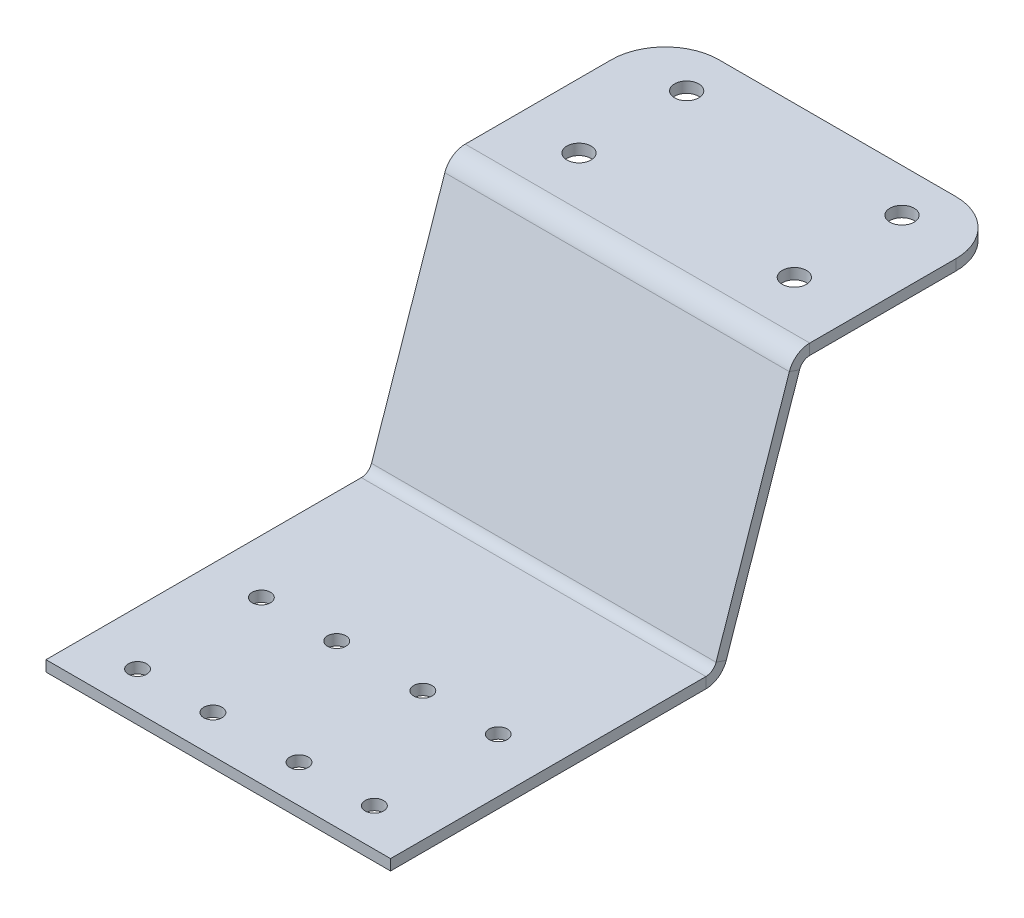
ISO-10303-21;
HEADER;
FILE_DESCRIPTION(('STEP AP214'),'2;1');
FILE_NAME('part.step','',(''),(''),'','','');
FILE_SCHEMA(('AUTOMOTIVE_DESIGN { 1 0 10303 214 1 1 1 1 }'));
ENDSEC;
DATA;
#1=APPLICATION_CONTEXT('core data for automotive mechanical design processes');
#2=APPLICATION_PROTOCOL_DEFINITION('international standard','automotive_design',2000,#1);
#3=PRODUCT_CONTEXT('',#1,'mechanical');
#4=PRODUCT('Part','Part','',(#3));
#5=PRODUCT_RELATED_PRODUCT_CATEGORY('part','',(#4));
#6=PRODUCT_DEFINITION_FORMATION('','',#4);
#7=PRODUCT_DEFINITION_CONTEXT('part definition',#1,'design');
#8=PRODUCT_DEFINITION('design','',#6,#7);
#9=PRODUCT_DEFINITION_SHAPE('','',#8);
#10=(LENGTH_UNIT() NAMED_UNIT(*) SI_UNIT(.MILLI.,.METRE.));
#11=(NAMED_UNIT(*) PLANE_ANGLE_UNIT() SI_UNIT($,.RADIAN.));
#12=(NAMED_UNIT(*) SI_UNIT($,.STERADIAN.) SOLID_ANGLE_UNIT());
#13=UNCERTAINTY_MEASURE_WITH_UNIT(LENGTH_MEASURE(1.E-05),#10,'distance_accuracy_value','');
#14=(GEOMETRIC_REPRESENTATION_CONTEXT(3) GLOBAL_UNCERTAINTY_ASSIGNED_CONTEXT((#13)) GLOBAL_UNIT_ASSIGNED_CONTEXT((#10,
#11,#12)) REPRESENTATION_CONTEXT('',''));
#15=CARTESIAN_POINT('',(0.,0.,0.));
#16=DIRECTION('',(0.,0.,1.));
#17=DIRECTION('',(1.,0.,0.));
#18=AXIS2_PLACEMENT_3D('',#15,#16,#17);
#19=CARTESIAN_POINT('',(32.,1.35465214442372,-60.4618132310535));
#20=DIRECTION('',(1.,0.,0.));
#21=DIRECTION('',(0.,0.,-1.));
#22=AXIS2_PLACEMENT_3D('',#19,#20,#21);
#23=PLANE('',#22);
#24=DIRECTION('',(0.,-0.322673927788138,-0.94651018817854));
#25=VECTOR('',#24,1.);
#26=CARTESIAN_POINT('',(32.,1.35465214442372,-60.4618132310535));
#27=LINE('',#26,#25);
#28=CARTESIAN_POINT('',(32.,1.35465214442372,-60.4618132310535));
#29=VERTEX_POINT('',#28);
#30=CARTESIAN_POINT('',(32.,0.709304288847448,-62.3548336074106));
#31=VERTEX_POINT('',#30);
#32=EDGE_CURVE('E265',#29,#31,#27,.T.);
#33=ORIENTED_EDGE('',*,*,#32,.F.);
#34=CARTESIAN_POINT('',(32.,2.,-58.5687928546965));
#35=DIRECTION('',(-1.,0.,0.));
#36=DIRECTION('',(0.,0.,1.));
#37=AXIS2_PLACEMENT_3D('',#34,#35,#36);
#38=CIRCLE('',#37,2.);
#39=CARTESIAN_POINT('',(32.,0.,-58.5687928546965));
#40=VERTEX_POINT('',#39);
#41=EDGE_CURVE('E175',#40,#29,#38,.F.);
#42=ORIENTED_EDGE('',*,*,#41,.F.);
#43=DIRECTION('',(0.,1.,0.));
#44=VECTOR('',#43,1.);
#45=CARTESIAN_POINT('',(32.,-2.,-58.5687928546965));
#46=LINE('',#45,#44);
#47=CARTESIAN_POINT('',(32.,-2.,-58.5687928546965));
#48=VERTEX_POINT('',#47);
#49=EDGE_CURVE('E263',#48,#40,#46,.T.);
#50=ORIENTED_EDGE('',*,*,#49,.F.);
#51=CARTESIAN_POINT('',(32.,2.,-58.5687928546965));
#52=DIRECTION('',(1.,0.,0.));
#53=DIRECTION('',(0.,0.,-1.));
#54=AXIS2_PLACEMENT_3D('',#51,#52,#53);
#55=CIRCLE('',#54,4.);
#56=EDGE_CURVE('E190',#48,#31,#55,.T.);
#57=ORIENTED_EDGE('',*,*,#56,.T.);
#58=EDGE_LOOP('',(#33,#42,#50,#57));
#59=FACE_BOUND('',#58,.T.);
#60=ADVANCED_FACE('F38',(#59),#23,.T.);
#61=CARTESIAN_POINT('',(32.,-2.,-58.5687928546965));
#62=DIRECTION('',(1.,0.,0.));
#63=DIRECTION('',(0.,0.,-1.));
#64=AXIS2_PLACEMENT_3D('',#61,#62,#63);
#65=PLANE('',#64);
#66=DIRECTION('',(0.,0.94651018817854,-0.322673927788138));
#67=VECTOR('',#66,1.);
#68=CARTESIAN_POINT('',(32.,0.,-60.));
#69=LINE('',#68,#67);
#70=CARTESIAN_POINT('',(32.,41.2906957111525,-74.0763735378929));
#71=VERTEX_POINT('',#70);
#72=EDGE_CURVE('E173',#29,#71,#69,.T.);
#73=ORIENTED_EDGE('',*,*,#72,.F.);
#74=ORIENTED_EDGE('',*,*,#32,.T.);
#75=DIRECTION('',(0.,0.94651018817854,-0.322673927788138));
#76=VECTOR('',#75,1.);
#77=CARTESIAN_POINT('',(32.,-0.645347855576277,-61.8930203763571));
#78=LINE('',#77,#76);
#79=CARTESIAN_POINT('',(32.,40.6453478555763,-75.96939391425));
#80=VERTEX_POINT('',#79);
#81=EDGE_CURVE('E193',#31,#80,#78,.T.);
#82=ORIENTED_EDGE('',*,*,#81,.T.);
#83=DIRECTION('',(0.,0.322673927788137,0.94651018817854));
#84=VECTOR('',#83,1.);
#85=CARTESIAN_POINT('',(32.,40.6453478555763,-75.96939391425));
#86=LINE('',#85,#84);
#87=EDGE_CURVE('E153',#80,#71,#86,.T.);
#88=ORIENTED_EDGE('',*,*,#87,.T.);
#89=EDGE_LOOP('',(#73,#74,#82,#88));
#90=FACE_BOUND('',#89,.T.);
#91=ADVANCED_FACE('F395',(#90),#65,.T.);
#92=CARTESIAN_POINT('',(-32.,0.,-58.5687928546965));
#93=DIRECTION('',(-1.,0.,0.));
#94=DIRECTION('',(0.,0.,1.));
#95=AXIS2_PLACEMENT_3D('',#92,#93,#94);
#96=PLANE('',#95);
#97=DIRECTION('',(0.,-1.,0.));
#98=VECTOR('',#97,1.);
#99=CARTESIAN_POINT('',(-32.,0.,-58.5687928546965));
#100=LINE('',#99,#98);
#101=CARTESIAN_POINT('',(-32.,0.,-58.5687928546965));
#102=VERTEX_POINT('',#101);
#103=CARTESIAN_POINT('',(-32.,-2.,-58.5687928546965));
#104=VERTEX_POINT('',#103);
#105=EDGE_CURVE('E261',#102,#104,#100,.T.);
#106=ORIENTED_EDGE('',*,*,#105,.F.);
#107=CARTESIAN_POINT('',(-32.,2.,-58.5687928546965));
#108=DIRECTION('',(-1.,0.,0.));
#109=DIRECTION('',(0.,0.,1.));
#110=AXIS2_PLACEMENT_3D('',#107,#108,#109);
#111=CIRCLE('',#110,2.);
#112=CARTESIAN_POINT('',(-32.,1.35465214442372,-60.4618132310535));
#113=VERTEX_POINT('',#112);
#114=EDGE_CURVE('E208',#102,#113,#111,.F.);
#115=ORIENTED_EDGE('',*,*,#114,.T.);
#116=DIRECTION('',(0.,0.322673927788138,0.94651018817854));
#117=VECTOR('',#116,1.);
#118=CARTESIAN_POINT('',(-32.,0.709304288847448,-62.3548336074106));
#119=LINE('',#118,#117);
#120=CARTESIAN_POINT('',(-32.,0.709304288847448,-62.3548336074106));
#121=VERTEX_POINT('',#120);
#122=EDGE_CURVE('E152',#121,#113,#119,.T.);
#123=ORIENTED_EDGE('',*,*,#122,.F.);
#124=CARTESIAN_POINT('',(-32.,2.,-58.5687928546965));
#125=DIRECTION('',(1.,0.,0.));
#126=DIRECTION('',(0.,0.,-1.));
#127=AXIS2_PLACEMENT_3D('',#124,#125,#126);
#128=CIRCLE('',#127,4.);
#129=EDGE_CURVE('E220',#104,#121,#128,.T.);
#130=ORIENTED_EDGE('',*,*,#129,.F.);
#131=EDGE_LOOP('',(#106,#115,#123,#130));
#132=FACE_BOUND('',#131,.T.);
#133=ADVANCED_FACE('F401',(#132),#96,.T.);
#134=CARTESIAN_POINT('',(-32.,0.709304288847448,-62.3548336074106));
#135=DIRECTION('',(-1.,0.,0.));
#136=DIRECTION('',(0.,0.,1.));
#137=AXIS2_PLACEMENT_3D('',#134,#135,#136);
#138=PLANE('',#137);
#139=DIRECTION('',(0.,0.,-1.));
#140=VECTOR('',#139,1.);
#141=CARTESIAN_POINT('',(-32.,0.,0.));
#142=LINE('',#141,#140);
#143=CARTESIAN_POINT('',(-32.,0.,0.));
#144=VERTEX_POINT('',#143);
#145=EDGE_CURVE('E211',#144,#102,#142,.T.);
#146=ORIENTED_EDGE('',*,*,#145,.T.);
#147=ORIENTED_EDGE('',*,*,#105,.T.);
#148=DIRECTION('',(0.,0.,-1.));
#149=VECTOR('',#148,1.);
#150=CARTESIAN_POINT('',(-32.,-2.,0.));
#151=LINE('',#150,#149);
#152=CARTESIAN_POINT('',(-32.,-2.,0.));
#153=VERTEX_POINT('',#152);
#154=EDGE_CURVE('E217',#153,#104,#151,.T.);
#155=ORIENTED_EDGE('',*,*,#154,.F.);
#156=DIRECTION('',(0.,1.,0.));
#157=VECTOR('',#156,1.);
#158=CARTESIAN_POINT('',(-32.,-2.,0.));
#159=LINE('',#158,#157);
#160=EDGE_CURVE('E214',#153,#144,#159,.T.);
#161=ORIENTED_EDGE('',*,*,#160,.T.);
#162=EDGE_LOOP('',(#146,#147,#155,#161));
#163=FACE_BOUND('',#162,.T.);
#164=ADVANCED_FACE('F698',(#163),#138,.T.);
#165=CARTESIAN_POINT('',(32.,44.,-77.8624142906071));
#166=DIRECTION('',(1.,0.,0.));
#167=DIRECTION('',(0.,0.,-1.));
#168=AXIS2_PLACEMENT_3D('',#165,#166,#167);
#169=PLANE('',#168);
#170=DIRECTION('',(0.,-1.,0.));
#171=VECTOR('',#170,1.);
#172=CARTESIAN_POINT('',(32.,44.,-77.8624142906071));
#173=LINE('',#172,#171);
#174=CARTESIAN_POINT('',(32.,44.,-77.8624142906071));
#175=VERTEX_POINT('',#174);
#176=CARTESIAN_POINT('',(32.,42.,-77.8624142906071));
#177=VERTEX_POINT('',#176);
#178=EDGE_CURVE('E143',#175,#177,#173,.T.);
#179=ORIENTED_EDGE('',*,*,#178,.F.);
#180=CARTESIAN_POINT('',(32.,40.,-77.8624142906071));
#181=DIRECTION('',(1.,0.,0.));
#182=DIRECTION('',(0.,0.,-1.));
#183=AXIS2_PLACEMENT_3D('',#180,#181,#182);
#184=CIRCLE('',#183,4.);
#185=EDGE_CURVE('E147',#71,#175,#184,.F.);
#186=ORIENTED_EDGE('',*,*,#185,.F.);
#187=ORIENTED_EDGE('',*,*,#87,.F.);
#188=CARTESIAN_POINT('',(32.,40.,-77.8624142906071));
#189=DIRECTION('',(1.,0.,0.));
#190=DIRECTION('',(0.,0.,-1.));
#191=AXIS2_PLACEMENT_3D('',#188,#189,#190);
#192=CIRCLE('',#191,2.);
#193=EDGE_CURVE('E150',#80,#177,#192,.F.);
#194=ORIENTED_EDGE('',*,*,#193,.T.);
#195=EDGE_LOOP('',(#179,#186,#187,#194));
#196=FACE_BOUND('',#195,.T.);
#197=ADVANCED_FACE('F145',(#196),#169,.T.);
#198=CARTESIAN_POINT('',(32.,40.6453478555763,-75.96939391425));
#199=DIRECTION('',(1.,0.,0.));
#200=DIRECTION('',(0.,0.,-1.));
#201=AXIS2_PLACEMENT_3D('',#198,#199,#200);
#202=PLANE('',#201);
#203=DIRECTION('',(0.,0.,-1.));
#204=VECTOR('',#203,1.);
#205=CARTESIAN_POINT('',(32.,42.,-75.));
#206=LINE('',#205,#204);
#207=CARTESIAN_POINT('',(32.,42.,-105.));
#208=VERTEX_POINT('',#207);
#209=EDGE_CURVE('E168',#177,#208,#206,.T.);
#210=ORIENTED_EDGE('',*,*,#209,.T.);
#211=DIRECTION('',(0.,-1.,0.));
#212=VECTOR('',#211,1.);
#213=CARTESIAN_POINT('',(32.,40.6453478555763,-105.));
#214=LINE('',#213,#212);
#215=CARTESIAN_POINT('',(32.,44.,-105.));
#216=VERTEX_POINT('',#215);
#217=EDGE_CURVE('E61',#208,#216,#214,.F.);
#218=ORIENTED_EDGE('',*,*,#217,.T.);
#219=DIRECTION('',(0.,0.,-1.));
#220=VECTOR('',#219,1.);
#221=CARTESIAN_POINT('',(32.,44.,-75.));
#222=LINE('',#221,#220);
#223=EDGE_CURVE('E158',#175,#216,#222,.T.);
#224=ORIENTED_EDGE('',*,*,#223,.F.);
#225=ORIENTED_EDGE('',*,*,#178,.T.);
#226=EDGE_LOOP('',(#210,#218,#224,#225));
#227=FACE_BOUND('',#226,.T.);
#228=ADVANCED_FACE('F167',(#227),#202,.T.);
#229=CARTESIAN_POINT('',(-32.,41.2906957111525,-74.0763735378929));
#230=DIRECTION('',(-1.,0.,0.));
#231=DIRECTION('',(0.,0.,1.));
#232=AXIS2_PLACEMENT_3D('',#229,#230,#231);
#233=PLANE('',#232);
#234=DIRECTION('',(0.,-0.322673927788137,-0.94651018817854));
#235=VECTOR('',#234,1.);
#236=CARTESIAN_POINT('',(-32.,41.2906957111525,-74.0763735378929));
#237=LINE('',#236,#235);
#238=CARTESIAN_POINT('',(-32.,41.2906957111525,-74.0763735378929));
#239=VERTEX_POINT('',#238);
#240=CARTESIAN_POINT('',(-32.,40.6453478555763,-75.96939391425));
#241=VERTEX_POINT('',#240);
#242=EDGE_CURVE('E257',#239,#241,#237,.T.);
#243=ORIENTED_EDGE('',*,*,#242,.F.);
#244=CARTESIAN_POINT('',(-32.,40.,-77.8624142906071));
#245=DIRECTION('',(1.,0.,0.));
#246=DIRECTION('',(0.,0.,-1.));
#247=AXIS2_PLACEMENT_3D('',#244,#245,#246);
#248=CIRCLE('',#247,4.);
#249=CARTESIAN_POINT('',(-32.,44.,-77.8624142906071));
#250=VERTEX_POINT('',#249);
#251=EDGE_CURVE('E203',#239,#250,#248,.F.);
#252=ORIENTED_EDGE('',*,*,#251,.T.);
#253=DIRECTION('',(0.,1.,0.));
#254=VECTOR('',#253,1.);
#255=CARTESIAN_POINT('',(-32.,42.,-77.8624142906071));
#256=LINE('',#255,#254);
#257=CARTESIAN_POINT('',(-32.,42.,-77.8624142906071));
#258=VERTEX_POINT('',#257);
#259=EDGE_CURVE('E255',#258,#250,#256,.T.);
#260=ORIENTED_EDGE('',*,*,#259,.F.);
#261=CARTESIAN_POINT('',(-32.,40.,-77.8624142906071));
#262=DIRECTION('',(1.,0.,0.));
#263=DIRECTION('',(0.,0.,-1.));
#264=AXIS2_PLACEMENT_3D('',#261,#262,#263);
#265=CIRCLE('',#264,2.);
#266=EDGE_CURVE('E226',#241,#258,#265,.F.);
#267=ORIENTED_EDGE('',*,*,#266,.F.);
#268=EDGE_LOOP('',(#243,#252,#260,#267));
#269=FACE_BOUND('',#268,.T.);
#270=ADVANCED_FACE('F390',(#269),#233,.T.);
#271=CARTESIAN_POINT('',(-32.,42.,-77.8624142906071));
#272=DIRECTION('',(-1.,0.,0.));
#273=DIRECTION('',(0.,0.,1.));
#274=AXIS2_PLACEMENT_3D('',#271,#272,#273);
#275=PLANE('',#274);
#276=DIRECTION('',(0.,0.94651018817854,-0.322673927788138));
#277=VECTOR('',#276,1.);
#278=CARTESIAN_POINT('',(-32.,0.,-60.));
#279=LINE('',#278,#277);
#280=EDGE_CURVE('E205',#113,#239,#279,.T.);
#281=ORIENTED_EDGE('',*,*,#280,.T.);
#282=ORIENTED_EDGE('',*,*,#242,.T.);
#283=DIRECTION('',(0.,0.94651018817854,-0.322673927788138));
#284=VECTOR('',#283,1.);
#285=CARTESIAN_POINT('',(-32.,-0.645347855576277,-61.8930203763571));
#286=LINE('',#285,#284);
#287=EDGE_CURVE('E223',#121,#241,#286,.T.);
#288=ORIENTED_EDGE('',*,*,#287,.F.);
#289=ORIENTED_EDGE('',*,*,#122,.T.);
#290=EDGE_LOOP('',(#281,#282,#288,#289));
#291=FACE_BOUND('',#290,.T.);
#292=ADVANCED_FACE('F382',(#291),#275,.T.);
#293=CARTESIAN_POINT('',(32.,42.,-75.));
#294=DIRECTION('',(0.,1.,0.));
#295=DIRECTION('',(0.,0.,1.));
#296=AXIS2_PLACEMENT_3D('',#293,#294,#295);
#297=PLANE('',#296);
#298=CARTESIAN_POINT('',(-20.,42.,-107.));
#299=DIRECTION('',(0.,1.,0.));
#300=DIRECTION('',(0.,0.,1.));
#301=AXIS2_PLACEMENT_3D('',#298,#299,#300);
#302=CIRCLE('',#301,2.25);
#303=CARTESIAN_POINT('',(-20.,42.,-104.75));
#304=VERTEX_POINT('',#303);
#305=EDGE_CURVE('E354',#304,#304,#302,.T.);
#306=ORIENTED_EDGE('',*,*,#305,.T.);
#307=EDGE_LOOP('',(#306));
#308=FACE_BOUND('',#307,.T.);
#309=CARTESIAN_POINT('',(-20.,42.,-87.));
#310=DIRECTION('',(0.,1.,0.));
#311=DIRECTION('',(0.,0.,1.));
#312=AXIS2_PLACEMENT_3D('',#309,#310,#311);
#313=CIRCLE('',#312,2.25);
#314=CARTESIAN_POINT('',(-20.,42.,-84.75));
#315=VERTEX_POINT('',#314);
#316=EDGE_CURVE('E348',#315,#315,#313,.T.);
#317=ORIENTED_EDGE('',*,*,#316,.T.);
#318=EDGE_LOOP('',(#317));
#319=FACE_BOUND('',#318,.T.);
#320=CARTESIAN_POINT('',(20.,42.,-87.));
#321=DIRECTION('',(0.,1.,0.));
#322=DIRECTION('',(0.,0.,1.));
#323=AXIS2_PLACEMENT_3D('',#320,#321,#322);
#324=CIRCLE('',#323,2.25);
#325=CARTESIAN_POINT('',(20.,42.,-84.75));
#326=VERTEX_POINT('',#325);
#327=EDGE_CURVE('E342',#326,#326,#324,.T.);
#328=ORIENTED_EDGE('',*,*,#327,.T.);
#329=EDGE_LOOP('',(#328));
#330=FACE_BOUND('',#329,.T.);
#331=CARTESIAN_POINT('',(20.,42.,-107.));
#332=DIRECTION('',(0.,1.,0.));
#333=DIRECTION('',(0.,0.,1.));
#334=AXIS2_PLACEMENT_3D('',#331,#332,#333);
#335=CIRCLE('',#334,2.25);
#336=CARTESIAN_POINT('',(20.,42.,-104.75));
#337=VERTEX_POINT('',#336);
#338=EDGE_CURVE('E336',#337,#337,#335,.T.);
#339=ORIENTED_EDGE('',*,*,#338,.T.);
#340=EDGE_LOOP('',(#339));
#341=FACE_BOUND('',#340,.T.);
#342=DIRECTION('',(-1.,0.,0.));
#343=VECTOR('',#342,1.);
#344=CARTESIAN_POINT('',(32.,42.,-115.));
#345=LINE('',#344,#343);
#346=CARTESIAN_POINT('',(22.,42.,-115.));
#347=VERTEX_POINT('',#346);
#348=CARTESIAN_POINT('',(-22.,42.,-115.));
#349=VERTEX_POINT('',#348);
#350=EDGE_CURVE('E252',#347,#349,#345,.T.);
#351=ORIENTED_EDGE('',*,*,#350,.F.);
#352=CARTESIAN_POINT('',(22.,42.,-105.));
#353=DIRECTION('',(0.,1.,0.));
#354=DIRECTION('',(0.,0.,1.));
#355=AXIS2_PLACEMENT_3D('',#352,#353,#354);
#356=CIRCLE('',#355,10.);
#357=EDGE_CURVE('E274',#347,#208,#356,.F.);
#358=ORIENTED_EDGE('',*,*,#357,.T.);
#359=ORIENTED_EDGE('',*,*,#209,.F.);
#360=DIRECTION('',(-1.,0.,0.));
#361=VECTOR('',#360,1.);
#362=CARTESIAN_POINT('',(32.,42.,-77.8624142906071));
#363=LINE('',#362,#361);
#364=EDGE_CURVE('E197',#177,#258,#363,.T.);
#365=ORIENTED_EDGE('',*,*,#364,.T.);
#366=DIRECTION('',(0.,0.,-1.));
#367=VECTOR('',#366,1.);
#368=CARTESIAN_POINT('',(-32.,42.,-75.));
#369=LINE('',#368,#367);
#370=CARTESIAN_POINT('',(-32.,42.,-105.));
#371=VERTEX_POINT('',#370);
#372=EDGE_CURVE('E198',#258,#371,#369,.T.);
#373=ORIENTED_EDGE('',*,*,#372,.T.);
#374=CARTESIAN_POINT('',(-22.,42.,-105.));
#375=DIRECTION('',(0.,1.,0.));
#376=DIRECTION('',(0.,0.,1.));
#377=AXIS2_PLACEMENT_3D('',#374,#375,#376);
#378=CIRCLE('',#377,10.);
#379=EDGE_CURVE('E272',#371,#349,#378,.F.);
#380=ORIENTED_EDGE('',*,*,#379,.T.);
#381=EDGE_LOOP('',(#351,#358,#359,#365,#373,#380));
#382=FACE_BOUND('',#381,.T.);
#383=ADVANCED_FACE('F287',(#308,#319,#330,#341,#382),#297,.F.);
#384=CARTESIAN_POINT('',(32.,44.,-115.));
#385=DIRECTION('',(0.,0.,-1.));
#386=DIRECTION('',(-1.,0.,0.));
#387=AXIS2_PLACEMENT_3D('',#384,#385,#386);
#388=PLANE('',#387);
#389=DIRECTION('',(-1.,0.,0.));
#390=VECTOR('',#389,1.);
#391=CARTESIAN_POINT('',(32.,44.,-115.));
#392=LINE('',#391,#390);
#393=CARTESIAN_POINT('',(22.,44.,-115.));
#394=VERTEX_POINT('',#393);
#395=CARTESIAN_POINT('',(-22.,44.,-115.));
#396=VERTEX_POINT('',#395);
#397=EDGE_CURVE('E164',#394,#396,#392,.T.);
#398=ORIENTED_EDGE('',*,*,#397,.F.);
#399=DIRECTION('',(0.,-1.,0.));
#400=VECTOR('',#399,1.);
#401=CARTESIAN_POINT('',(22.,44.,-115.));
#402=LINE('',#401,#400);
#403=EDGE_CURVE('E269',#394,#347,#402,.T.);
#404=ORIENTED_EDGE('',*,*,#403,.T.);
#405=ORIENTED_EDGE('',*,*,#350,.T.);
#406=DIRECTION('',(0.,-1.,0.));
#407=VECTOR('',#406,1.);
#408=CARTESIAN_POINT('',(-22.,44.,-115.));
#409=LINE('',#408,#407);
#410=EDGE_CURVE('E267',#349,#396,#409,.F.);
#411=ORIENTED_EDGE('',*,*,#410,.T.);
#412=EDGE_LOOP('',(#398,#404,#405,#411));
#413=FACE_BOUND('',#412,.T.);
#414=ADVANCED_FACE('F281',(#413),#388,.T.);
#415=CARTESIAN_POINT('',(32.,44.,-75.));
#416=DIRECTION('',(0.,1.,0.));
#417=DIRECTION('',(0.,0.,1.));
#418=AXIS2_PLACEMENT_3D('',#415,#416,#417);
#419=PLANE('',#418);
#420=CARTESIAN_POINT('',(-20.,44.,-107.));
#421=DIRECTION('',(0.,1.,0.));
#422=DIRECTION('',(0.,0.,1.));
#423=AXIS2_PLACEMENT_3D('',#420,#421,#422);
#424=CIRCLE('',#423,2.25);
#425=CARTESIAN_POINT('',(-20.,44.,-104.75));
#426=VERTEX_POINT('',#425);
#427=EDGE_CURVE('E357',#426,#426,#424,.T.);
#428=ORIENTED_EDGE('',*,*,#427,.F.);
#429=EDGE_LOOP('',(#428));
#430=FACE_BOUND('',#429,.T.);
#431=CARTESIAN_POINT('',(-20.,44.,-87.));
#432=DIRECTION('',(0.,1.,0.));
#433=DIRECTION('',(0.,0.,1.));
#434=AXIS2_PLACEMENT_3D('',#431,#432,#433);
#435=CIRCLE('',#434,2.25);
#436=CARTESIAN_POINT('',(-20.,44.,-84.75));
#437=VERTEX_POINT('',#436);
#438=EDGE_CURVE('E351',#437,#437,#435,.T.);
#439=ORIENTED_EDGE('',*,*,#438,.F.);
#440=EDGE_LOOP('',(#439));
#441=FACE_BOUND('',#440,.T.);
#442=CARTESIAN_POINT('',(20.,44.,-87.));
#443=DIRECTION('',(0.,1.,0.));
#444=DIRECTION('',(0.,0.,1.));
#445=AXIS2_PLACEMENT_3D('',#442,#443,#444);
#446=CIRCLE('',#445,2.25);
#447=CARTESIAN_POINT('',(20.,44.,-84.75));
#448=VERTEX_POINT('',#447);
#449=EDGE_CURVE('E345',#448,#448,#446,.T.);
#450=ORIENTED_EDGE('',*,*,#449,.F.);
#451=EDGE_LOOP('',(#450));
#452=FACE_BOUND('',#451,.T.);
#453=CARTESIAN_POINT('',(20.,44.,-107.));
#454=DIRECTION('',(0.,1.,0.));
#455=DIRECTION('',(0.,0.,1.));
#456=AXIS2_PLACEMENT_3D('',#453,#454,#455);
#457=CIRCLE('',#456,2.25);
#458=CARTESIAN_POINT('',(20.,44.,-104.75));
#459=VERTEX_POINT('',#458);
#460=EDGE_CURVE('E339',#459,#459,#457,.T.);
#461=ORIENTED_EDGE('',*,*,#460,.F.);
#462=EDGE_LOOP('',(#461));
#463=FACE_BOUND('',#462,.T.);
#464=ORIENTED_EDGE('',*,*,#223,.T.);
#465=CARTESIAN_POINT('',(22.,44.,-105.));
#466=DIRECTION('',(0.,1.,0.));
#467=DIRECTION('',(0.,0.,1.));
#468=AXIS2_PLACEMENT_3D('',#465,#466,#467);
#469=CIRCLE('',#468,10.);
#470=EDGE_CURVE('E46',#216,#394,#469,.T.);
#471=ORIENTED_EDGE('',*,*,#470,.T.);
#472=ORIENTED_EDGE('',*,*,#397,.T.);
#473=CARTESIAN_POINT('',(-22.,44.,-105.));
#474=DIRECTION('',(0.,1.,0.));
#475=DIRECTION('',(0.,0.,1.));
#476=AXIS2_PLACEMENT_3D('',#473,#474,#475);
#477=CIRCLE('',#476,10.);
#478=CARTESIAN_POINT('',(-32.,44.,-105.));
#479=VERTEX_POINT('',#478);
#480=EDGE_CURVE('E53',#396,#479,#477,.T.);
#481=ORIENTED_EDGE('',*,*,#480,.T.);
#482=DIRECTION('',(0.,0.,-1.));
#483=VECTOR('',#482,1.);
#484=CARTESIAN_POINT('',(-32.,44.,-75.));
#485=LINE('',#484,#483);
#486=EDGE_CURVE('E160',#250,#479,#485,.T.);
#487=ORIENTED_EDGE('',*,*,#486,.F.);
#488=DIRECTION('',(-1.,0.,0.));
#489=VECTOR('',#488,1.);
#490=CARTESIAN_POINT('',(32.,44.,-77.8624142906071));
#491=LINE('',#490,#489);
#492=EDGE_CURVE('E156',#175,#250,#491,.T.);
#493=ORIENTED_EDGE('',*,*,#492,.F.);
#494=EDGE_LOOP('',(#464,#471,#472,#481,#487,#493));
#495=FACE_BOUND('',#494,.T.);
#496=ADVANCED_FACE('F157',(#430,#441,#452,#463,#495),#419,.T.);
#497=CARTESIAN_POINT('',(32.,40.,-77.8624142906071));
#498=DIRECTION('',(-1.,0.,0.));
#499=DIRECTION('',(0.,0.,1.));
#500=AXIS2_PLACEMENT_3D('',#497,#498,#499);
#501=CYLINDRICAL_SURFACE('',#500,4.);
#502=ORIENTED_EDGE('',*,*,#251,.F.);
#503=DIRECTION('',(-1.,0.,0.));
#504=VECTOR('',#503,1.);
#505=CARTESIAN_POINT('',(32.,41.2906957111525,-74.0763735378929));
#506=LINE('',#505,#504);
#507=EDGE_CURVE('E165',#71,#239,#506,.T.);
#508=ORIENTED_EDGE('',*,*,#507,.F.);
#509=ORIENTED_EDGE('',*,*,#185,.T.);
#510=ORIENTED_EDGE('',*,*,#492,.T.);
#511=EDGE_LOOP('',(#502,#508,#509,#510));
#512=FACE_BOUND('',#511,.T.);
#513=ADVANCED_FACE('F171',(#512),#501,.T.);
#514=CARTESIAN_POINT('',(32.,0.,-60.));
#515=DIRECTION('',(0.,0.322673927788138,0.94651018817854));
#516=DIRECTION('',(0.,-0.94651018817854,0.322673927788138));
#517=AXIS2_PLACEMENT_3D('',#514,#515,#516);
#518=PLANE('',#517);
#519=ORIENTED_EDGE('',*,*,#280,.F.);
#520=DIRECTION('',(-1.,0.,0.));
#521=VECTOR('',#520,1.);
#522=CARTESIAN_POINT('',(32.,1.35465214442372,-60.4618132310535));
#523=LINE('',#522,#521);
#524=EDGE_CURVE('E247',#29,#113,#523,.T.);
#525=ORIENTED_EDGE('',*,*,#524,.F.);
#526=ORIENTED_EDGE('',*,*,#72,.T.);
#527=ORIENTED_EDGE('',*,*,#507,.T.);
#528=EDGE_LOOP('',(#519,#525,#526,#527));
#529=FACE_BOUND('',#528,.T.);
#530=ADVANCED_FACE('F488',(#529),#518,.T.);
#531=CARTESIAN_POINT('',(32.,2.,-58.5687928546965));
#532=DIRECTION('',(-1.,0.,0.));
#533=DIRECTION('',(0.,0.,1.));
#534=AXIS2_PLACEMENT_3D('',#531,#532,#533);
#535=CYLINDRICAL_SURFACE('',#534,2.);
#536=ORIENTED_EDGE('',*,*,#114,.F.);
#537=DIRECTION('',(-1.,0.,0.));
#538=VECTOR('',#537,1.);
#539=CARTESIAN_POINT('',(32.,0.,-58.5687928546965));
#540=LINE('',#539,#538);
#541=EDGE_CURVE('E244',#40,#102,#540,.T.);
#542=ORIENTED_EDGE('',*,*,#541,.F.);
#543=ORIENTED_EDGE('',*,*,#41,.T.);
#544=ORIENTED_EDGE('',*,*,#524,.T.);
#545=EDGE_LOOP('',(#536,#542,#543,#544));
#546=FACE_BOUND('',#545,.T.);
#547=ADVANCED_FACE('F484',(#546),#535,.F.);
#548=CARTESIAN_POINT('',(32.,0.,0.));
#549=DIRECTION('',(0.,1.,0.));
#550=DIRECTION('',(0.,0.,1.));
#551=AXIS2_PLACEMENT_3D('',#548,#549,#550);
#552=PLANE('',#551);
#553=CARTESIAN_POINT('',(-22.,0.,-30.));
#554=DIRECTION('',(0.,1.,0.));
#555=DIRECTION('',(0.,0.,1.));
#556=AXIS2_PLACEMENT_3D('',#553,#554,#555);
#557=CIRCLE('',#556,1.7);
#558=CARTESIAN_POINT('',(-22.,0.,-28.3));
#559=VERTEX_POINT('',#558);
#560=EDGE_CURVE('E333',#559,#559,#557,.T.);
#561=ORIENTED_EDGE('',*,*,#560,.F.);
#562=EDGE_LOOP('',(#561));
#563=FACE_BOUND('',#562,.T.);
#564=CARTESIAN_POINT('',(-22.,0.,-7.));
#565=DIRECTION('',(0.,1.,0.));
#566=DIRECTION('',(0.,0.,1.));
#567=AXIS2_PLACEMENT_3D('',#564,#565,#566);
#568=CIRCLE('',#567,1.7);
#569=CARTESIAN_POINT('',(-22.,0.,-5.3));
#570=VERTEX_POINT('',#569);
#571=EDGE_CURVE('E327',#570,#570,#568,.T.);
#572=ORIENTED_EDGE('',*,*,#571,.F.);
#573=EDGE_LOOP('',(#572));
#574=FACE_BOUND('',#573,.T.);
#575=CARTESIAN_POINT('',(-8.,0.,-7.));
#576=DIRECTION('',(0.,1.,0.));
#577=DIRECTION('',(0.,0.,1.));
#578=AXIS2_PLACEMENT_3D('',#575,#576,#577);
#579=CIRCLE('',#578,1.7);
#580=CARTESIAN_POINT('',(-8.,0.,-5.3));
#581=VERTEX_POINT('',#580);
#582=EDGE_CURVE('E321',#581,#581,#579,.T.);
#583=ORIENTED_EDGE('',*,*,#582,.F.);
#584=EDGE_LOOP('',(#583));
#585=FACE_BOUND('',#584,.T.);
#586=CARTESIAN_POINT('',(-8.,0.,-30.));
#587=DIRECTION('',(0.,1.,0.));
#588=DIRECTION('',(0.,0.,1.));
#589=AXIS2_PLACEMENT_3D('',#586,#587,#588);
#590=CIRCLE('',#589,1.7);
#591=CARTESIAN_POINT('',(-8.,0.,-28.3));
#592=VERTEX_POINT('',#591);
#593=EDGE_CURVE('E315',#592,#592,#590,.T.);
#594=ORIENTED_EDGE('',*,*,#593,.F.);
#595=EDGE_LOOP('',(#594));
#596=FACE_BOUND('',#595,.T.);
#597=CARTESIAN_POINT('',(8.,0.,-30.));
#598=DIRECTION('',(0.,1.,0.));
#599=DIRECTION('',(0.,0.,1.));
#600=AXIS2_PLACEMENT_3D('',#597,#598,#599);
#601=CIRCLE('',#600,1.7);
#602=CARTESIAN_POINT('',(8.,0.,-28.3));
#603=VERTEX_POINT('',#602);
#604=EDGE_CURVE('E309',#603,#603,#601,.T.);
#605=ORIENTED_EDGE('',*,*,#604,.F.);
#606=EDGE_LOOP('',(#605));
#607=FACE_BOUND('',#606,.T.);
#608=CARTESIAN_POINT('',(8.,0.,-7.));
#609=DIRECTION('',(0.,1.,0.));
#610=DIRECTION('',(0.,0.,1.));
#611=AXIS2_PLACEMENT_3D('',#608,#609,#610);
#612=CIRCLE('',#611,1.7);
#613=CARTESIAN_POINT('',(8.,0.,-5.3));
#614=VERTEX_POINT('',#613);
#615=EDGE_CURVE('E303',#614,#614,#612,.T.);
#616=ORIENTED_EDGE('',*,*,#615,.F.);
#617=EDGE_LOOP('',(#616));
#618=FACE_BOUND('',#617,.T.);
#619=CARTESIAN_POINT('',(22.,0.,-7.));
#620=DIRECTION('',(0.,1.,0.));
#621=DIRECTION('',(0.,0.,1.));
#622=AXIS2_PLACEMENT_3D('',#619,#620,#621);
#623=CIRCLE('',#622,1.7);
#624=CARTESIAN_POINT('',(22.,0.,-5.3));
#625=VERTEX_POINT('',#624);
#626=EDGE_CURVE('E297',#625,#625,#623,.T.);
#627=ORIENTED_EDGE('',*,*,#626,.F.);
#628=EDGE_LOOP('',(#627));
#629=FACE_BOUND('',#628,.T.);
#630=CARTESIAN_POINT('',(22.,0.,-30.));
#631=DIRECTION('',(0.,1.,0.));
#632=DIRECTION('',(0.,0.,1.));
#633=AXIS2_PLACEMENT_3D('',#630,#631,#632);
#634=CIRCLE('',#633,1.7);
#635=CARTESIAN_POINT('',(22.,0.,-28.3));
#636=VERTEX_POINT('',#635);
#637=EDGE_CURVE('E291',#636,#636,#634,.T.);
#638=ORIENTED_EDGE('',*,*,#637,.F.);
#639=EDGE_LOOP('',(#638));
#640=FACE_BOUND('',#639,.T.);
#641=ORIENTED_EDGE('',*,*,#145,.F.);
#642=DIRECTION('',(-1.,0.,0.));
#643=VECTOR('',#642,1.);
#644=CARTESIAN_POINT('',(32.,0.,0.));
#645=LINE('',#644,#643);
#646=CARTESIAN_POINT('',(32.,0.,0.));
#647=VERTEX_POINT('',#646);
#648=EDGE_CURVE('E242',#647,#144,#645,.T.);
#649=ORIENTED_EDGE('',*,*,#648,.F.);
#650=DIRECTION('',(0.,0.,-1.));
#651=VECTOR('',#650,1.);
#652=CARTESIAN_POINT('',(32.,0.,0.));
#653=LINE('',#652,#651);
#654=EDGE_CURVE('E181',#647,#40,#653,.T.);
#655=ORIENTED_EDGE('',*,*,#654,.T.);
#656=ORIENTED_EDGE('',*,*,#541,.T.);
#657=EDGE_LOOP('',(#641,#649,#655,#656));
#658=FACE_BOUND('',#657,.T.);
#659=ADVANCED_FACE('F480',(#563,#574,#585,#596,#607,#618,#629,#640,#658),#552,.T.);
#660=CARTESIAN_POINT('',(32.,-2.,0.));
#661=DIRECTION('',(0.,0.,1.));
#662=DIRECTION('',(1.,0.,0.));
#663=AXIS2_PLACEMENT_3D('',#660,#661,#662);
#664=PLANE('',#663);
#665=ORIENTED_EDGE('',*,*,#160,.F.);
#666=DIRECTION('',(-1.,0.,0.));
#667=VECTOR('',#666,1.);
#668=CARTESIAN_POINT('',(32.,-2.,0.));
#669=LINE('',#668,#667);
#670=CARTESIAN_POINT('',(32.,-2.,0.));
#671=VERTEX_POINT('',#670);
#672=EDGE_CURVE('E240',#671,#153,#669,.T.);
#673=ORIENTED_EDGE('',*,*,#672,.F.);
#674=DIRECTION('',(0.,1.,0.));
#675=VECTOR('',#674,1.);
#676=CARTESIAN_POINT('',(32.,-2.,0.));
#677=LINE('',#676,#675);
#678=EDGE_CURVE('E184',#671,#647,#677,.T.);
#679=ORIENTED_EDGE('',*,*,#678,.T.);
#680=ORIENTED_EDGE('',*,*,#648,.T.);
#681=EDGE_LOOP('',(#665,#673,#679,#680));
#682=FACE_BOUND('',#681,.T.);
#683=ADVANCED_FACE('F476',(#682),#664,.T.);
#684=CARTESIAN_POINT('',(32.,-2.,0.));
#685=DIRECTION('',(0.,1.,0.));
#686=DIRECTION('',(0.,0.,1.));
#687=AXIS2_PLACEMENT_3D('',#684,#685,#686);
#688=PLANE('',#687);
#689=CARTESIAN_POINT('',(-22.,-2.,-30.));
#690=DIRECTION('',(0.,1.,0.));
#691=DIRECTION('',(0.,0.,1.));
#692=AXIS2_PLACEMENT_3D('',#689,#690,#691);
#693=CIRCLE('',#692,1.7);
#694=CARTESIAN_POINT('',(-22.,-2.,-28.3));
#695=VERTEX_POINT('',#694);
#696=EDGE_CURVE('E330',#695,#695,#693,.T.);
#697=ORIENTED_EDGE('',*,*,#696,.T.);
#698=EDGE_LOOP('',(#697));
#699=FACE_BOUND('',#698,.T.);
#700=CARTESIAN_POINT('',(-22.,-2.,-7.));
#701=DIRECTION('',(0.,1.,0.));
#702=DIRECTION('',(0.,0.,1.));
#703=AXIS2_PLACEMENT_3D('',#700,#701,#702);
#704=CIRCLE('',#703,1.7);
#705=CARTESIAN_POINT('',(-22.,-2.,-5.3));
#706=VERTEX_POINT('',#705);
#707=EDGE_CURVE('E324',#706,#706,#704,.T.);
#708=ORIENTED_EDGE('',*,*,#707,.T.);
#709=EDGE_LOOP('',(#708));
#710=FACE_BOUND('',#709,.T.);
#711=CARTESIAN_POINT('',(-8.,-2.,-7.));
#712=DIRECTION('',(0.,1.,0.));
#713=DIRECTION('',(0.,0.,1.));
#714=AXIS2_PLACEMENT_3D('',#711,#712,#713);
#715=CIRCLE('',#714,1.7);
#716=CARTESIAN_POINT('',(-8.,-2.,-5.3));
#717=VERTEX_POINT('',#716);
#718=EDGE_CURVE('E318',#717,#717,#715,.T.);
#719=ORIENTED_EDGE('',*,*,#718,.T.);
#720=EDGE_LOOP('',(#719));
#721=FACE_BOUND('',#720,.T.);
#722=CARTESIAN_POINT('',(-8.,-2.,-30.));
#723=DIRECTION('',(0.,1.,0.));
#724=DIRECTION('',(0.,0.,1.));
#725=AXIS2_PLACEMENT_3D('',#722,#723,#724);
#726=CIRCLE('',#725,1.7);
#727=CARTESIAN_POINT('',(-8.,-2.,-28.3));
#728=VERTEX_POINT('',#727);
#729=EDGE_CURVE('E312',#728,#728,#726,.T.);
#730=ORIENTED_EDGE('',*,*,#729,.T.);
#731=EDGE_LOOP('',(#730));
#732=FACE_BOUND('',#731,.T.);
#733=CARTESIAN_POINT('',(8.,-2.,-30.));
#734=DIRECTION('',(0.,1.,0.));
#735=DIRECTION('',(0.,0.,1.));
#736=AXIS2_PLACEMENT_3D('',#733,#734,#735);
#737=CIRCLE('',#736,1.7);
#738=CARTESIAN_POINT('',(8.,-2.,-28.3));
#739=VERTEX_POINT('',#738);
#740=EDGE_CURVE('E306',#739,#739,#737,.T.);
#741=ORIENTED_EDGE('',*,*,#740,.T.);
#742=EDGE_LOOP('',(#741));
#743=FACE_BOUND('',#742,.T.);
#744=CARTESIAN_POINT('',(8.,-2.,-7.));
#745=DIRECTION('',(0.,1.,0.));
#746=DIRECTION('',(0.,0.,1.));
#747=AXIS2_PLACEMENT_3D('',#744,#745,#746);
#748=CIRCLE('',#747,1.7);
#749=CARTESIAN_POINT('',(8.,-2.,-5.3));
#750=VERTEX_POINT('',#749);
#751=EDGE_CURVE('E300',#750,#750,#748,.T.);
#752=ORIENTED_EDGE('',*,*,#751,.T.);
#753=EDGE_LOOP('',(#752));
#754=FACE_BOUND('',#753,.T.);
#755=CARTESIAN_POINT('',(22.,-2.,-7.));
#756=DIRECTION('',(0.,1.,0.));
#757=DIRECTION('',(0.,0.,1.));
#758=AXIS2_PLACEMENT_3D('',#755,#756,#757);
#759=CIRCLE('',#758,1.7);
#760=CARTESIAN_POINT('',(22.,-2.,-5.3));
#761=VERTEX_POINT('',#760);
#762=EDGE_CURVE('E294',#761,#761,#759,.T.);
#763=ORIENTED_EDGE('',*,*,#762,.T.);
#764=EDGE_LOOP('',(#763));
#765=FACE_BOUND('',#764,.T.);
#766=CARTESIAN_POINT('',(22.,-2.,-30.));
#767=DIRECTION('',(0.,1.,0.));
#768=DIRECTION('',(0.,0.,1.));
#769=AXIS2_PLACEMENT_3D('',#766,#767,#768);
#770=CIRCLE('',#769,1.7);
#771=CARTESIAN_POINT('',(22.,-2.,-28.3));
#772=VERTEX_POINT('',#771);
#773=EDGE_CURVE('E201',#772,#772,#770,.T.);
#774=ORIENTED_EDGE('',*,*,#773,.T.);
#775=EDGE_LOOP('',(#774));
#776=FACE_BOUND('',#775,.T.);
#777=ORIENTED_EDGE('',*,*,#154,.T.);
#778=DIRECTION('',(-1.,0.,0.));
#779=VECTOR('',#778,1.);
#780=CARTESIAN_POINT('',(32.,-2.,-58.5687928546965));
#781=LINE('',#780,#779);
#782=EDGE_CURVE('E237',#48,#104,#781,.T.);
#783=ORIENTED_EDGE('',*,*,#782,.F.);
#784=DIRECTION('',(0.,0.,-1.));
#785=VECTOR('',#784,1.);
#786=CARTESIAN_POINT('',(32.,-2.,0.));
#787=LINE('',#786,#785);
#788=EDGE_CURVE('E187',#671,#48,#787,.T.);
#789=ORIENTED_EDGE('',*,*,#788,.F.);
#790=ORIENTED_EDGE('',*,*,#672,.T.);
#791=EDGE_LOOP('',(#777,#783,#789,#790));
#792=FACE_BOUND('',#791,.T.);
#793=ADVANCED_FACE('F472',(#699,#710,#721,#732,#743,#754,#765,#776,#792),#688,.F.);
#794=CARTESIAN_POINT('',(32.,2.,-58.5687928546965));
#795=DIRECTION('',(-1.,0.,0.));
#796=DIRECTION('',(0.,0.,1.));
#797=AXIS2_PLACEMENT_3D('',#794,#795,#796);
#798=CYLINDRICAL_SURFACE('',#797,4.);
#799=ORIENTED_EDGE('',*,*,#129,.T.);
#800=DIRECTION('',(-1.,0.,0.));
#801=VECTOR('',#800,1.);
#802=CARTESIAN_POINT('',(32.,0.709304288847448,-62.3548336074106));
#803=LINE('',#802,#801);
#804=EDGE_CURVE('E234',#31,#121,#803,.T.);
#805=ORIENTED_EDGE('',*,*,#804,.F.);
#806=ORIENTED_EDGE('',*,*,#56,.F.);
#807=ORIENTED_EDGE('',*,*,#782,.T.);
#808=EDGE_LOOP('',(#799,#805,#806,#807));
#809=FACE_BOUND('',#808,.T.);
#810=ADVANCED_FACE('F468',(#809),#798,.T.);
#811=CARTESIAN_POINT('',(32.,-0.645347855576277,-61.8930203763571));
#812=DIRECTION('',(0.,0.322673927788138,0.94651018817854));
#813=DIRECTION('',(0.,-0.94651018817854,0.322673927788138));
#814=AXIS2_PLACEMENT_3D('',#811,#812,#813);
#815=PLANE('',#814);
#816=ORIENTED_EDGE('',*,*,#287,.T.);
#817=DIRECTION('',(-1.,0.,0.));
#818=VECTOR('',#817,1.);
#819=CARTESIAN_POINT('',(32.,40.6453478555763,-75.96939391425));
#820=LINE('',#819,#818);
#821=EDGE_CURVE('E231',#80,#241,#820,.T.);
#822=ORIENTED_EDGE('',*,*,#821,.F.);
#823=ORIENTED_EDGE('',*,*,#81,.F.);
#824=ORIENTED_EDGE('',*,*,#804,.T.);
#825=EDGE_LOOP('',(#816,#822,#823,#824));
#826=FACE_BOUND('',#825,.T.);
#827=ADVANCED_FACE('F464',(#826),#815,.F.);
#828=CARTESIAN_POINT('',(32.,40.,-77.8624142906071));
#829=DIRECTION('',(-1.,0.,0.));
#830=DIRECTION('',(0.,0.,1.));
#831=AXIS2_PLACEMENT_3D('',#828,#829,#830);
#832=CYLINDRICAL_SURFACE('',#831,2.);
#833=ORIENTED_EDGE('',*,*,#266,.T.);
#834=ORIENTED_EDGE('',*,*,#364,.F.);
#835=ORIENTED_EDGE('',*,*,#193,.F.);
#836=ORIENTED_EDGE('',*,*,#821,.T.);
#837=EDGE_LOOP('',(#833,#834,#835,#836));
#838=FACE_BOUND('',#837,.T.);
#839=ADVANCED_FACE('F457',(#838),#832,.F.);
#840=CARTESIAN_POINT('',(32.,40.,-77.8624142906071));
#841=DIRECTION('',(1.,0.,0.));
#842=DIRECTION('',(0.,0.,-1.));
#843=AXIS2_PLACEMENT_3D('',#840,#841,#842);
#844=PLANE('',#843);
#845=ORIENTED_EDGE('',*,*,#788,.T.);
#846=ORIENTED_EDGE('',*,*,#49,.T.);
#847=ORIENTED_EDGE('',*,*,#654,.F.);
#848=ORIENTED_EDGE('',*,*,#678,.F.);
#849=EDGE_LOOP('',(#845,#846,#847,#848));
#850=FACE_BOUND('',#849,.T.);
#851=ADVANCED_FACE('F454',(#850),#844,.T.);
#852=CARTESIAN_POINT('',(-32.,40.,-77.8624142906071));
#853=DIRECTION('',(1.,0.,0.));
#854=DIRECTION('',(0.,0.,-1.));
#855=AXIS2_PLACEMENT_3D('',#852,#853,#854);
#856=PLANE('',#855);
#857=ORIENTED_EDGE('',*,*,#486,.T.);
#858=DIRECTION('',(0.,-1.,0.));
#859=VECTOR('',#858,1.);
#860=CARTESIAN_POINT('',(-32.,42.,-105.));
#861=LINE('',#860,#859);
#862=EDGE_CURVE('E11',#479,#371,#861,.T.);
#863=ORIENTED_EDGE('',*,*,#862,.T.);
#864=ORIENTED_EDGE('',*,*,#372,.F.);
#865=ORIENTED_EDGE('',*,*,#259,.T.);
#866=EDGE_LOOP('',(#857,#863,#864,#865));
#867=FACE_BOUND('',#866,.T.);
#868=ADVANCED_FACE('F452',(#867),#856,.F.);
#869=CARTESIAN_POINT('',(22.,0.,-30.));
#870=DIRECTION('',(0.,1.,0.));
#871=DIRECTION('',(0.,0.,1.));
#872=AXIS2_PLACEMENT_3D('',#869,#870,#871);
#873=CYLINDRICAL_SURFACE('',#872,1.7);
#874=ORIENTED_EDGE('',*,*,#773,.F.);
#875=EDGE_LOOP('',(#874));
#876=FACE_BOUND('',#875,.T.);
#877=ORIENTED_EDGE('',*,*,#637,.T.);
#878=EDGE_LOOP('',(#877));
#879=FACE_BOUND('',#878,.T.);
#880=ADVANCED_FACE('F448',(#876,#879),#873,.F.);
#881=CARTESIAN_POINT('',(22.,0.,-7.));
#882=DIRECTION('',(0.,1.,0.));
#883=DIRECTION('',(0.,0.,1.));
#884=AXIS2_PLACEMENT_3D('',#881,#882,#883);
#885=CYLINDRICAL_SURFACE('',#884,1.7);
#886=ORIENTED_EDGE('',*,*,#762,.F.);
#887=EDGE_LOOP('',(#886));
#888=FACE_BOUND('',#887,.T.);
#889=ORIENTED_EDGE('',*,*,#626,.T.);
#890=EDGE_LOOP('',(#889));
#891=FACE_BOUND('',#890,.T.);
#892=ADVANCED_FACE('F444',(#888,#891),#885,.F.);
#893=CARTESIAN_POINT('',(8.,0.,-7.));
#894=DIRECTION('',(0.,1.,0.));
#895=DIRECTION('',(0.,0.,1.));
#896=AXIS2_PLACEMENT_3D('',#893,#894,#895);
#897=CYLINDRICAL_SURFACE('',#896,1.7);
#898=ORIENTED_EDGE('',*,*,#751,.F.);
#899=EDGE_LOOP('',(#898));
#900=FACE_BOUND('',#899,.T.);
#901=ORIENTED_EDGE('',*,*,#615,.T.);
#902=EDGE_LOOP('',(#901));
#903=FACE_BOUND('',#902,.T.);
#904=ADVANCED_FACE('F440',(#900,#903),#897,.F.);
#905=CARTESIAN_POINT('',(8.,0.,-30.));
#906=DIRECTION('',(0.,1.,0.));
#907=DIRECTION('',(0.,0.,1.));
#908=AXIS2_PLACEMENT_3D('',#905,#906,#907);
#909=CYLINDRICAL_SURFACE('',#908,1.7);
#910=ORIENTED_EDGE('',*,*,#740,.F.);
#911=EDGE_LOOP('',(#910));
#912=FACE_BOUND('',#911,.T.);
#913=ORIENTED_EDGE('',*,*,#604,.T.);
#914=EDGE_LOOP('',(#913));
#915=FACE_BOUND('',#914,.T.);
#916=ADVANCED_FACE('F436',(#912,#915),#909,.F.);
#917=CARTESIAN_POINT('',(-8.,0.,-30.));
#918=DIRECTION('',(0.,1.,0.));
#919=DIRECTION('',(0.,0.,1.));
#920=AXIS2_PLACEMENT_3D('',#917,#918,#919);
#921=CYLINDRICAL_SURFACE('',#920,1.7);
#922=ORIENTED_EDGE('',*,*,#729,.F.);
#923=EDGE_LOOP('',(#922));
#924=FACE_BOUND('',#923,.T.);
#925=ORIENTED_EDGE('',*,*,#593,.T.);
#926=EDGE_LOOP('',(#925));
#927=FACE_BOUND('',#926,.T.);
#928=ADVANCED_FACE('F432',(#924,#927),#921,.F.);
#929=CARTESIAN_POINT('',(-8.,0.,-7.));
#930=DIRECTION('',(0.,1.,0.));
#931=DIRECTION('',(0.,0.,1.));
#932=AXIS2_PLACEMENT_3D('',#929,#930,#931);
#933=CYLINDRICAL_SURFACE('',#932,1.7);
#934=ORIENTED_EDGE('',*,*,#718,.F.);
#935=EDGE_LOOP('',(#934));
#936=FACE_BOUND('',#935,.T.);
#937=ORIENTED_EDGE('',*,*,#582,.T.);
#938=EDGE_LOOP('',(#937));
#939=FACE_BOUND('',#938,.T.);
#940=ADVANCED_FACE('F428',(#936,#939),#933,.F.);
#941=CARTESIAN_POINT('',(-22.,0.,-7.));
#942=DIRECTION('',(0.,1.,0.));
#943=DIRECTION('',(0.,0.,1.));
#944=AXIS2_PLACEMENT_3D('',#941,#942,#943);
#945=CYLINDRICAL_SURFACE('',#944,1.7);
#946=ORIENTED_EDGE('',*,*,#707,.F.);
#947=EDGE_LOOP('',(#946));
#948=FACE_BOUND('',#947,.T.);
#949=ORIENTED_EDGE('',*,*,#571,.T.);
#950=EDGE_LOOP('',(#949));
#951=FACE_BOUND('',#950,.T.);
#952=ADVANCED_FACE('F424',(#948,#951),#945,.F.);
#953=CARTESIAN_POINT('',(-22.,0.,-30.));
#954=DIRECTION('',(0.,1.,0.));
#955=DIRECTION('',(0.,0.,1.));
#956=AXIS2_PLACEMENT_3D('',#953,#954,#955);
#957=CYLINDRICAL_SURFACE('',#956,1.7);
#958=ORIENTED_EDGE('',*,*,#696,.F.);
#959=EDGE_LOOP('',(#958));
#960=FACE_BOUND('',#959,.T.);
#961=ORIENTED_EDGE('',*,*,#560,.T.);
#962=EDGE_LOOP('',(#961));
#963=FACE_BOUND('',#962,.T.);
#964=ADVANCED_FACE('F377',(#960,#963),#957,.F.);
#965=CARTESIAN_POINT('',(20.,44.,-107.));
#966=DIRECTION('',(0.,1.,0.));
#967=DIRECTION('',(0.,0.,1.));
#968=AXIS2_PLACEMENT_3D('',#965,#966,#967);
#969=CYLINDRICAL_SURFACE('',#968,2.25);
#970=ORIENTED_EDGE('',*,*,#460,.T.);
#971=EDGE_LOOP('',(#970));
#972=FACE_BOUND('',#971,.T.);
#973=ORIENTED_EDGE('',*,*,#338,.F.);
#974=EDGE_LOOP('',(#973));
#975=FACE_BOUND('',#974,.T.);
#976=ADVANCED_FACE('F373',(#972,#975),#969,.F.);
#977=CARTESIAN_POINT('',(20.,44.,-87.));
#978=DIRECTION('',(0.,1.,0.));
#979=DIRECTION('',(0.,0.,1.));
#980=AXIS2_PLACEMENT_3D('',#977,#978,#979);
#981=CYLINDRICAL_SURFACE('',#980,2.25);
#982=ORIENTED_EDGE('',*,*,#449,.T.);
#983=EDGE_LOOP('',(#982));
#984=FACE_BOUND('',#983,.T.);
#985=ORIENTED_EDGE('',*,*,#327,.F.);
#986=EDGE_LOOP('',(#985));
#987=FACE_BOUND('',#986,.T.);
#988=ADVANCED_FACE('F376',(#984,#987),#981,.F.);
#989=CARTESIAN_POINT('',(-20.,44.,-87.));
#990=DIRECTION('',(0.,1.,0.));
#991=DIRECTION('',(0.,0.,1.));
#992=AXIS2_PLACEMENT_3D('',#989,#990,#991);
#993=CYLINDRICAL_SURFACE('',#992,2.25);
#994=ORIENTED_EDGE('',*,*,#438,.T.);
#995=EDGE_LOOP('',(#994));
#996=FACE_BOUND('',#995,.T.);
#997=ORIENTED_EDGE('',*,*,#316,.F.);
#998=EDGE_LOOP('',(#997));
#999=FACE_BOUND('',#998,.T.);
#1000=ADVANCED_FACE('F411',(#996,#999),#993,.F.);
#1001=CARTESIAN_POINT('',(-20.,44.,-107.));
#1002=DIRECTION('',(0.,1.,0.));
#1003=DIRECTION('',(0.,0.,1.));
#1004=AXIS2_PLACEMENT_3D('',#1001,#1002,#1003);
#1005=CYLINDRICAL_SURFACE('',#1004,2.25);
#1006=ORIENTED_EDGE('',*,*,#427,.T.);
#1007=EDGE_LOOP('',(#1006));
#1008=FACE_BOUND('',#1007,.T.);
#1009=ORIENTED_EDGE('',*,*,#305,.F.);
#1010=EDGE_LOOP('',(#1009));
#1011=FACE_BOUND('',#1010,.T.);
#1012=ADVANCED_FACE('F361',(#1008,#1011),#1005,.F.);
#1013=CARTESIAN_POINT('',(22.,44.,-105.));
#1014=DIRECTION('',(0.,-1.,0.));
#1015=DIRECTION('',(0.,0.,-1.));
#1016=AXIS2_PLACEMENT_3D('',#1013,#1014,#1015);
#1017=CYLINDRICAL_SURFACE('',#1016,10.);
#1018=ORIENTED_EDGE('',*,*,#470,.F.);
#1019=ORIENTED_EDGE('',*,*,#217,.F.);
#1020=ORIENTED_EDGE('',*,*,#357,.F.);
#1021=ORIENTED_EDGE('',*,*,#403,.F.);
#1022=EDGE_LOOP('',(#1018,#1019,#1020,#1021));
#1023=FACE_BOUND('',#1022,.T.);
#1024=ADVANCED_FACE('F284',(#1023),#1017,.T.);
#1025=CARTESIAN_POINT('',(-22.,40.,-105.));
#1026=DIRECTION('',(0.,1.,0.));
#1027=DIRECTION('',(0.,0.,1.));
#1028=AXIS2_PLACEMENT_3D('',#1025,#1026,#1027);
#1029=CYLINDRICAL_SURFACE('',#1028,10.);
#1030=ORIENTED_EDGE('',*,*,#480,.F.);
#1031=ORIENTED_EDGE('',*,*,#410,.F.);
#1032=ORIENTED_EDGE('',*,*,#379,.F.);
#1033=ORIENTED_EDGE('',*,*,#862,.F.);
#1034=EDGE_LOOP('',(#1030,#1031,#1032,#1033));
#1035=FACE_BOUND('',#1034,.T.);
#1036=ADVANCED_FACE('F40',(#1035),#1029,.T.);
#1037=CLOSED_SHELL('',(#60,#91,#133,#164,#197,#228,#270,#292,#383,#414,#496,#513,#530,#547,#659,
#683,#793,#810,#827,#839,#851,#868,#880,#892,#904,#916,#928,#940,#952,#964,#976,#988,#1000,
#1012,#1024,#1036));
#1038=MANIFOLD_SOLID_BREP('B2',#1037);
#1039=ADVANCED_BREP_SHAPE_REPRESENTATION('',(#18,#1038),#14);
#1040=SHAPE_DEFINITION_REPRESENTATION(#9,#1039);
ENDSEC;
END-ISO-10303-21;
